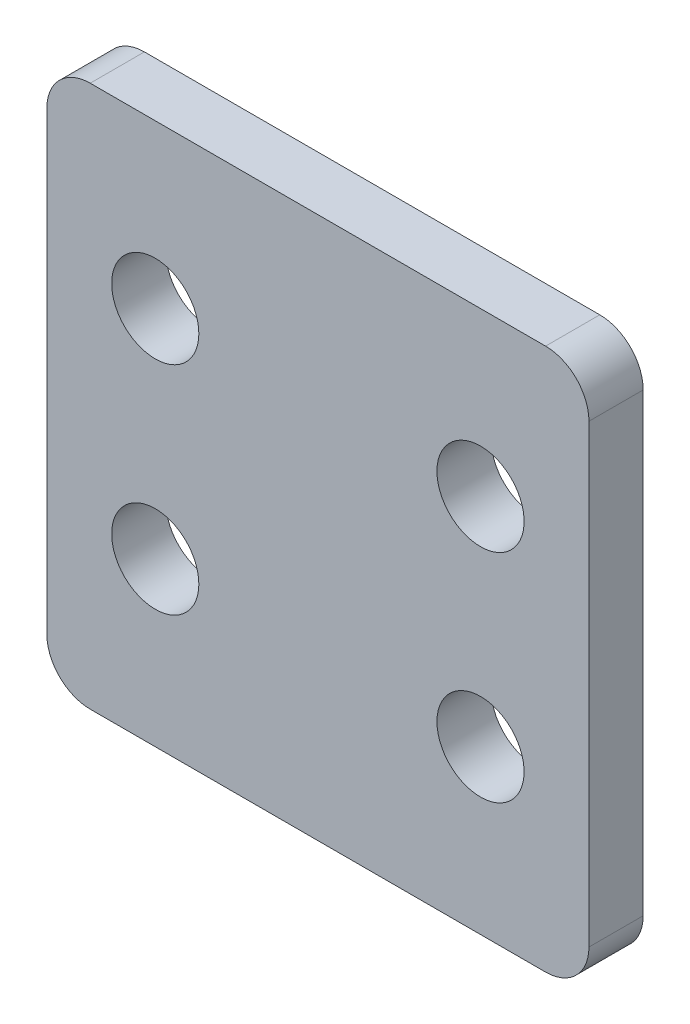
ISO-10303-21;
HEADER;
FILE_DESCRIPTION(('STEP AP214'),'2;1');
FILE_NAME('part.step','',(''),(''),'','','');
FILE_SCHEMA(('AUTOMOTIVE_DESIGN { 1 0 10303 214 1 1 1 1 }'));
ENDSEC;
DATA;
#1=APPLICATION_CONTEXT('core data for automotive mechanical design processes');
#2=APPLICATION_PROTOCOL_DEFINITION('international standard','automotive_design',2000,#1);
#3=PRODUCT_CONTEXT('',#1,'mechanical');
#4=PRODUCT('Part','Part','',(#3));
#5=PRODUCT_RELATED_PRODUCT_CATEGORY('part','',(#4));
#6=PRODUCT_DEFINITION_FORMATION('','',#4);
#7=PRODUCT_DEFINITION_CONTEXT('part definition',#1,'design');
#8=PRODUCT_DEFINITION('design','',#6,#7);
#9=PRODUCT_DEFINITION_SHAPE('','',#8);
#10=(LENGTH_UNIT() NAMED_UNIT(*) SI_UNIT(.MILLI.,.METRE.));
#11=(NAMED_UNIT(*) PLANE_ANGLE_UNIT() SI_UNIT($,.RADIAN.));
#12=(NAMED_UNIT(*) SI_UNIT($,.STERADIAN.) SOLID_ANGLE_UNIT());
#13=UNCERTAINTY_MEASURE_WITH_UNIT(LENGTH_MEASURE(1.E-05),#10,'distance_accuracy_value','');
#14=(GEOMETRIC_REPRESENTATION_CONTEXT(3) GLOBAL_UNCERTAINTY_ASSIGNED_CONTEXT((#13)) GLOBAL_UNIT_ASSIGNED_CONTEXT((#10,
#11,#12)) REPRESENTATION_CONTEXT('',''));
#15=CARTESIAN_POINT('',(0.,0.,0.));
#16=DIRECTION('',(0.,0.,1.));
#17=DIRECTION('',(1.,0.,0.));
#18=AXIS2_PLACEMENT_3D('',#15,#16,#17);
#19=CARTESIAN_POINT('',(0.,0.,3.175));
#20=DIRECTION('',(0.,0.,-1.));
#21=DIRECTION('',(-1.,0.,0.));
#22=AXIS2_PLACEMENT_3D('',#19,#20,#21);
#23=PLANE('',#22);
#24=DIRECTION('',(-1.,0.,0.));
#25=VECTOR('',#24,1.);
#26=CARTESIAN_POINT('',(-15.875,15.875,3.175));
#27=LINE('',#26,#25);
#28=CARTESIAN_POINT('',(13.335,15.875,3.175));
#29=VERTEX_POINT('',#28);
#30=CARTESIAN_POINT('',(-13.335,15.875,3.175));
#31=VERTEX_POINT('',#30);
#32=EDGE_CURVE('E170',#29,#31,#27,.T.);
#33=ORIENTED_EDGE('',*,*,#32,.T.);
#34=CARTESIAN_POINT('',(-13.335,13.335,3.175));
#35=DIRECTION('',(0.,0.,-1.));
#36=DIRECTION('',(-1.,0.,0.));
#37=AXIS2_PLACEMENT_3D('',#34,#35,#36);
#38=CIRCLE('',#37,2.54);
#39=CARTESIAN_POINT('',(-15.875,13.335,3.175));
#40=VERTEX_POINT('',#39);
#41=EDGE_CURVE('E151',#31,#40,#38,.F.);
#42=ORIENTED_EDGE('',*,*,#41,.T.);
#43=DIRECTION('',(0.,-1.,0.));
#44=VECTOR('',#43,1.);
#45=CARTESIAN_POINT('',(-15.875,-15.875,3.175));
#46=LINE('',#45,#44);
#47=CARTESIAN_POINT('',(-15.875,-13.335,3.175));
#48=VERTEX_POINT('',#47);
#49=EDGE_CURVE('E121',#40,#48,#46,.T.);
#50=ORIENTED_EDGE('',*,*,#49,.T.);
#51=CARTESIAN_POINT('',(-13.335,-13.335,3.175));
#52=DIRECTION('',(0.,0.,-1.));
#53=DIRECTION('',(-1.,0.,0.));
#54=AXIS2_PLACEMENT_3D('',#51,#52,#53);
#55=CIRCLE('',#54,2.54);
#56=CARTESIAN_POINT('',(-13.335,-15.875,3.175));
#57=VERTEX_POINT('',#56);
#58=EDGE_CURVE('E57',#48,#57,#55,.F.);
#59=ORIENTED_EDGE('',*,*,#58,.T.);
#60=DIRECTION('',(1.,0.,0.));
#61=VECTOR('',#60,1.);
#62=CARTESIAN_POINT('',(-15.875,-15.875,3.175));
#63=LINE('',#62,#61);
#64=CARTESIAN_POINT('',(13.335,-15.875,3.175));
#65=VERTEX_POINT('',#64);
#66=EDGE_CURVE('E137',#57,#65,#63,.T.);
#67=ORIENTED_EDGE('',*,*,#66,.T.);
#68=CARTESIAN_POINT('',(13.335,-13.335,3.175));
#69=DIRECTION('',(0.,0.,-1.));
#70=DIRECTION('',(-1.,0.,0.));
#71=AXIS2_PLACEMENT_3D('',#68,#69,#70);
#72=CIRCLE('',#71,2.54);
#73=CARTESIAN_POINT('',(15.875,-13.335,3.175));
#74=VERTEX_POINT('',#73);
#75=EDGE_CURVE('E148',#65,#74,#72,.F.);
#76=ORIENTED_EDGE('',*,*,#75,.T.);
#77=DIRECTION('',(0.,1.,0.));
#78=VECTOR('',#77,1.);
#79=CARTESIAN_POINT('',(15.875,-15.875,3.175));
#80=LINE('',#79,#78);
#81=CARTESIAN_POINT('',(15.875,13.335,3.175));
#82=VERTEX_POINT('',#81);
#83=EDGE_CURVE('E131',#74,#82,#80,.T.);
#84=ORIENTED_EDGE('',*,*,#83,.T.);
#85=CARTESIAN_POINT('',(13.335,13.335,3.175));
#86=DIRECTION('',(0.,0.,-1.));
#87=DIRECTION('',(-1.,0.,0.));
#88=AXIS2_PLACEMENT_3D('',#85,#86,#87);
#89=CIRCLE('',#88,2.54);
#90=EDGE_CURVE('E146',#82,#29,#89,.F.);
#91=ORIENTED_EDGE('',*,*,#90,.T.);
#92=EDGE_LOOP('',(#33,#42,#50,#59,#67,#76,#84,#91));
#93=FACE_BOUND('',#92,.T.);
#94=CARTESIAN_POINT('',(-9.52499999999991,-6.35,3.175));
#95=DIRECTION('',(0.,0.,1.));
#96=DIRECTION('',(1.,0.,0.));
#97=AXIS2_PLACEMENT_3D('',#94,#95,#96);
#98=CIRCLE('',#97,2.5527);
#99=CARTESIAN_POINT('',(-6.97229999999991,-6.35,3.175));
#100=VERTEX_POINT('',#99);
#101=EDGE_CURVE('E175',#100,#100,#98,.T.);
#102=ORIENTED_EDGE('',*,*,#101,.F.);
#103=EDGE_LOOP('',(#102));
#104=FACE_BOUND('',#103,.T.);
#105=CARTESIAN_POINT('',(9.52499999999991,-6.35,3.175));
#106=DIRECTION('',(0.,0.,1.));
#107=DIRECTION('',(-1.,0.,0.));
#108=AXIS2_PLACEMENT_3D('',#105,#106,#107);
#109=CIRCLE('',#108,2.5527);
#110=CARTESIAN_POINT('',(6.97229999999991,-6.35,3.175));
#111=VERTEX_POINT('',#110);
#112=EDGE_CURVE('E184',#111,#111,#109,.T.);
#113=ORIENTED_EDGE('',*,*,#112,.F.);
#114=EDGE_LOOP('',(#113));
#115=FACE_BOUND('',#114,.T.);
#116=CARTESIAN_POINT('',(-9.52499999999996,6.35,3.175));
#117=DIRECTION('',(0.,0.,1.));
#118=DIRECTION('',(1.,0.,0.));
#119=AXIS2_PLACEMENT_3D('',#116,#117,#118);
#120=CIRCLE('',#119,2.5527);
#121=CARTESIAN_POINT('',(-6.97229999999996,6.35,3.175));
#122=VERTEX_POINT('',#121);
#123=EDGE_CURVE('E189',#122,#122,#120,.T.);
#124=ORIENTED_EDGE('',*,*,#123,.F.);
#125=EDGE_LOOP('',(#124));
#126=FACE_BOUND('',#125,.T.);
#127=CARTESIAN_POINT('',(9.52499999999996,6.35,3.175));
#128=DIRECTION('',(0.,0.,1.));
#129=DIRECTION('',(-1.,0.,0.));
#130=AXIS2_PLACEMENT_3D('',#127,#128,#129);
#131=CIRCLE('',#130,2.5527);
#132=CARTESIAN_POINT('',(6.97229999999996,6.35,3.175));
#133=VERTEX_POINT('',#132);
#134=EDGE_CURVE('E195',#133,#133,#131,.T.);
#135=ORIENTED_EDGE('',*,*,#134,.F.);
#136=EDGE_LOOP('',(#135));
#137=FACE_BOUND('',#136,.T.);
#138=ADVANCED_FACE('F35',(#93,#104,#115,#126,#137),#23,.F.);
#139=CARTESIAN_POINT('',(0.,0.,0.));
#140=DIRECTION('',(0.,0.,-1.));
#141=DIRECTION('',(-1.,0.,0.));
#142=AXIS2_PLACEMENT_3D('',#139,#140,#141);
#143=PLANE('',#142);
#144=CARTESIAN_POINT('',(-9.52499999999996,6.35,0.));
#145=DIRECTION('',(0.,0.,1.));
#146=DIRECTION('',(1.,0.,0.));
#147=AXIS2_PLACEMENT_3D('',#144,#145,#146);
#148=CIRCLE('',#147,2.5527);
#149=CARTESIAN_POINT('',(-6.97229999999996,6.35,0.));
#150=VERTEX_POINT('',#149);
#151=EDGE_CURVE('E192',#150,#150,#148,.T.);
#152=ORIENTED_EDGE('',*,*,#151,.T.);
#153=EDGE_LOOP('',(#152));
#154=FACE_BOUND('',#153,.T.);
#155=CARTESIAN_POINT('',(-9.52499999999991,-6.35,0.));
#156=DIRECTION('',(0.,0.,1.));
#157=DIRECTION('',(1.,0.,0.));
#158=AXIS2_PLACEMENT_3D('',#155,#156,#157);
#159=CIRCLE('',#158,2.5527);
#160=CARTESIAN_POINT('',(-6.97229999999991,-6.35,0.));
#161=VERTEX_POINT('',#160);
#162=EDGE_CURVE('E177',#161,#161,#159,.T.);
#163=ORIENTED_EDGE('',*,*,#162,.T.);
#164=EDGE_LOOP('',(#163));
#165=FACE_BOUND('',#164,.T.);
#166=DIRECTION('',(0.,-1.,0.));
#167=VECTOR('',#166,1.);
#168=CARTESIAN_POINT('',(-15.875,-15.875,0.));
#169=LINE('',#168,#167);
#170=CARTESIAN_POINT('',(-15.875,13.335,0.));
#171=VERTEX_POINT('',#170);
#172=CARTESIAN_POINT('',(-15.875,-13.335,0.));
#173=VERTEX_POINT('',#172);
#174=EDGE_CURVE('E119',#171,#173,#169,.T.);
#175=ORIENTED_EDGE('',*,*,#174,.F.);
#176=CARTESIAN_POINT('',(-13.335,13.335,0.));
#177=DIRECTION('',(0.,0.,-1.));
#178=DIRECTION('',(-1.,0.,0.));
#179=AXIS2_PLACEMENT_3D('',#176,#177,#178);
#180=CIRCLE('',#179,2.54);
#181=CARTESIAN_POINT('',(-13.335,15.875,0.));
#182=VERTEX_POINT('',#181);
#183=EDGE_CURVE('E102',#171,#182,#180,.T.);
#184=ORIENTED_EDGE('',*,*,#183,.T.);
#185=DIRECTION('',(-1.,0.,0.));
#186=VECTOR('',#185,1.);
#187=CARTESIAN_POINT('',(-15.875,15.875,0.));
#188=LINE('',#187,#186);
#189=CARTESIAN_POINT('',(13.335,15.875,0.));
#190=VERTEX_POINT('',#189);
#191=EDGE_CURVE('E129',#190,#182,#188,.T.);
#192=ORIENTED_EDGE('',*,*,#191,.F.);
#193=CARTESIAN_POINT('',(13.335,13.335,0.));
#194=DIRECTION('',(0.,0.,-1.));
#195=DIRECTION('',(-1.,0.,0.));
#196=AXIS2_PLACEMENT_3D('',#193,#194,#195);
#197=CIRCLE('',#196,2.54);
#198=CARTESIAN_POINT('',(15.875,13.335,0.));
#199=VERTEX_POINT('',#198);
#200=EDGE_CURVE('E122',#190,#199,#197,.T.);
#201=ORIENTED_EDGE('',*,*,#200,.T.);
#202=DIRECTION('',(0.,1.,0.));
#203=VECTOR('',#202,1.);
#204=CARTESIAN_POINT('',(15.875,-15.875,0.));
#205=LINE('',#204,#203);
#206=CARTESIAN_POINT('',(15.875,-13.335,0.));
#207=VERTEX_POINT('',#206);
#208=EDGE_CURVE('E133',#207,#199,#205,.T.);
#209=ORIENTED_EDGE('',*,*,#208,.F.);
#210=CARTESIAN_POINT('',(13.335,-13.335,0.));
#211=DIRECTION('',(0.,0.,-1.));
#212=DIRECTION('',(-1.,0.,0.));
#213=AXIS2_PLACEMENT_3D('',#210,#211,#212);
#214=CIRCLE('',#213,2.54);
#215=CARTESIAN_POINT('',(13.335,-15.875,0.));
#216=VERTEX_POINT('',#215);
#217=EDGE_CURVE('E140',#207,#216,#214,.T.);
#218=ORIENTED_EDGE('',*,*,#217,.T.);
#219=DIRECTION('',(1.,0.,0.));
#220=VECTOR('',#219,1.);
#221=CARTESIAN_POINT('',(-15.875,-15.875,0.));
#222=LINE('',#221,#220);
#223=CARTESIAN_POINT('',(-13.335,-15.875,0.));
#224=VERTEX_POINT('',#223);
#225=EDGE_CURVE('E128',#224,#216,#222,.T.);
#226=ORIENTED_EDGE('',*,*,#225,.F.);
#227=CARTESIAN_POINT('',(-13.335,-13.335,0.));
#228=DIRECTION('',(0.,0.,-1.));
#229=DIRECTION('',(-1.,0.,0.));
#230=AXIS2_PLACEMENT_3D('',#227,#228,#229);
#231=CIRCLE('',#230,2.54);
#232=EDGE_CURVE('E113',#224,#173,#231,.T.);
#233=ORIENTED_EDGE('',*,*,#232,.T.);
#234=EDGE_LOOP('',(#175,#184,#192,#201,#209,#218,#226,#233));
#235=FACE_BOUND('',#234,.T.);
#236=CARTESIAN_POINT('',(9.52499999999991,-6.35,0.));
#237=DIRECTION('',(0.,0.,1.));
#238=DIRECTION('',(-1.,0.,0.));
#239=AXIS2_PLACEMENT_3D('',#236,#237,#238);
#240=CIRCLE('',#239,2.5527);
#241=CARTESIAN_POINT('',(6.97229999999991,-6.35,0.));
#242=VERTEX_POINT('',#241);
#243=EDGE_CURVE('E186',#242,#242,#240,.T.);
#244=ORIENTED_EDGE('',*,*,#243,.T.);
#245=EDGE_LOOP('',(#244));
#246=FACE_BOUND('',#245,.T.);
#247=CARTESIAN_POINT('',(9.52499999999996,6.35,0.));
#248=DIRECTION('',(0.,0.,1.));
#249=DIRECTION('',(-1.,0.,0.));
#250=AXIS2_PLACEMENT_3D('',#247,#248,#249);
#251=CIRCLE('',#250,2.5527);
#252=CARTESIAN_POINT('',(6.97229999999996,6.35,0.));
#253=VERTEX_POINT('',#252);
#254=EDGE_CURVE('E198',#253,#253,#251,.T.);
#255=ORIENTED_EDGE('',*,*,#254,.T.);
#256=EDGE_LOOP('',(#255));
#257=FACE_BOUND('',#256,.T.);
#258=ADVANCED_FACE('F125',(#154,#165,#235,#246,#257),#143,.T.);
#259=CARTESIAN_POINT('',(15.875,-15.875,3.175));
#260=DIRECTION('',(-1.,0.,0.));
#261=DIRECTION('',(0.,0.,1.));
#262=AXIS2_PLACEMENT_3D('',#259,#260,#261);
#263=PLANE('',#262);
#264=ORIENTED_EDGE('',*,*,#83,.F.);
#265=DIRECTION('',(0.,0.,-1.));
#266=VECTOR('',#265,1.);
#267=CARTESIAN_POINT('',(15.875,-13.335,3.175));
#268=LINE('',#267,#266);
#269=EDGE_CURVE('E11',#74,#207,#268,.T.);
#270=ORIENTED_EDGE('',*,*,#269,.T.);
#271=ORIENTED_EDGE('',*,*,#208,.T.);
#272=DIRECTION('',(0.,0.,-1.));
#273=VECTOR('',#272,1.);
#274=CARTESIAN_POINT('',(15.875,13.335,3.175));
#275=LINE('',#274,#273);
#276=EDGE_CURVE('E43',#199,#82,#275,.F.);
#277=ORIENTED_EDGE('',*,*,#276,.T.);
#278=EDGE_LOOP('',(#264,#270,#271,#277));
#279=FACE_BOUND('',#278,.T.);
#280=ADVANCED_FACE('F161',(#279),#263,.F.);
#281=CARTESIAN_POINT('',(-15.875,15.875,3.175));
#282=DIRECTION('',(0.,-1.,0.));
#283=DIRECTION('',(0.,0.,-1.));
#284=AXIS2_PLACEMENT_3D('',#281,#282,#283);
#285=PLANE('',#284);
#286=ORIENTED_EDGE('',*,*,#191,.T.);
#287=DIRECTION('',(0.,0.,-1.));
#288=VECTOR('',#287,1.);
#289=CARTESIAN_POINT('',(-13.335,15.875,3.175));
#290=LINE('',#289,#288);
#291=EDGE_CURVE('E107',#182,#31,#290,.F.);
#292=ORIENTED_EDGE('',*,*,#291,.T.);
#293=ORIENTED_EDGE('',*,*,#32,.F.);
#294=DIRECTION('',(0.,0.,-1.));
#295=VECTOR('',#294,1.);
#296=CARTESIAN_POINT('',(13.335,15.875,3.175));
#297=LINE('',#296,#295);
#298=EDGE_CURVE('E112',#29,#190,#297,.T.);
#299=ORIENTED_EDGE('',*,*,#298,.T.);
#300=EDGE_LOOP('',(#286,#292,#293,#299));
#301=FACE_BOUND('',#300,.T.);
#302=ADVANCED_FACE('F174',(#301),#285,.F.);
#303=CARTESIAN_POINT('',(-15.875,-15.875,3.175));
#304=DIRECTION('',(1.,0.,0.));
#305=DIRECTION('',(0.,0.,-1.));
#306=AXIS2_PLACEMENT_3D('',#303,#304,#305);
#307=PLANE('',#306);
#308=ORIENTED_EDGE('',*,*,#49,.F.);
#309=DIRECTION('',(0.,0.,-1.));
#310=VECTOR('',#309,1.);
#311=CARTESIAN_POINT('',(-15.875,13.335,3.175));
#312=LINE('',#311,#310);
#313=EDGE_CURVE('E106',#40,#171,#312,.T.);
#314=ORIENTED_EDGE('',*,*,#313,.T.);
#315=ORIENTED_EDGE('',*,*,#174,.T.);
#316=DIRECTION('',(0.,0.,-1.));
#317=VECTOR('',#316,1.);
#318=CARTESIAN_POINT('',(-15.875,-13.335,3.175));
#319=LINE('',#318,#317);
#320=EDGE_CURVE('E123',#173,#48,#319,.F.);
#321=ORIENTED_EDGE('',*,*,#320,.T.);
#322=EDGE_LOOP('',(#308,#314,#315,#321));
#323=FACE_BOUND('',#322,.T.);
#324=ADVANCED_FACE('F118',(#323),#307,.F.);
#325=CARTESIAN_POINT('',(-15.875,-15.875,3.175));
#326=DIRECTION('',(0.,1.,0.));
#327=DIRECTION('',(0.,0.,1.));
#328=AXIS2_PLACEMENT_3D('',#325,#326,#327);
#329=PLANE('',#328);
#330=ORIENTED_EDGE('',*,*,#66,.F.);
#331=DIRECTION('',(0.,0.,-1.));
#332=VECTOR('',#331,1.);
#333=CARTESIAN_POINT('',(-13.335,-15.875,3.175));
#334=LINE('',#333,#332);
#335=EDGE_CURVE('E154',#57,#224,#334,.T.);
#336=ORIENTED_EDGE('',*,*,#335,.T.);
#337=ORIENTED_EDGE('',*,*,#225,.T.);
#338=DIRECTION('',(0.,0.,-1.));
#339=VECTOR('',#338,1.);
#340=CARTESIAN_POINT('',(13.335,-15.875,3.175));
#341=LINE('',#340,#339);
#342=EDGE_CURVE('E50',#216,#65,#341,.F.);
#343=ORIENTED_EDGE('',*,*,#342,.T.);
#344=EDGE_LOOP('',(#330,#336,#337,#343));
#345=FACE_BOUND('',#344,.T.);
#346=ADVANCED_FACE('F218',(#345),#329,.F.);
#347=CARTESIAN_POINT('',(-9.52499999999991,-6.35,3.175));
#348=DIRECTION('',(0.,0.,-1.));
#349=DIRECTION('',(-1.,0.,0.));
#350=AXIS2_PLACEMENT_3D('',#347,#348,#349);
#351=CYLINDRICAL_SURFACE('',#350,2.5527);
#352=ORIENTED_EDGE('',*,*,#101,.T.);
#353=EDGE_LOOP('',(#352));
#354=FACE_BOUND('',#353,.T.);
#355=ORIENTED_EDGE('',*,*,#162,.F.);
#356=EDGE_LOOP('',(#355));
#357=FACE_BOUND('',#356,.T.);
#358=ADVANCED_FACE('F215',(#354,#357),#351,.F.);
#359=CARTESIAN_POINT('',(9.52499999999991,-6.35,3.175));
#360=DIRECTION('',(0.,0.,-1.));
#361=DIRECTION('',(-1.,0.,0.));
#362=AXIS2_PLACEMENT_3D('',#359,#360,#361);
#363=CYLINDRICAL_SURFACE('',#362,2.5527);
#364=ORIENTED_EDGE('',*,*,#112,.T.);
#365=EDGE_LOOP('',(#364));
#366=FACE_BOUND('',#365,.T.);
#367=ORIENTED_EDGE('',*,*,#243,.F.);
#368=EDGE_LOOP('',(#367));
#369=FACE_BOUND('',#368,.T.);
#370=ADVANCED_FACE('F310',(#366,#369),#363,.F.);
#371=CARTESIAN_POINT('',(-9.52499999999996,6.35,3.175));
#372=DIRECTION('',(0.,0.,-1.));
#373=DIRECTION('',(-1.,0.,0.));
#374=AXIS2_PLACEMENT_3D('',#371,#372,#373);
#375=CYLINDRICAL_SURFACE('',#374,2.5527);
#376=ORIENTED_EDGE('',*,*,#123,.T.);
#377=EDGE_LOOP('',(#376));
#378=FACE_BOUND('',#377,.T.);
#379=ORIENTED_EDGE('',*,*,#151,.F.);
#380=EDGE_LOOP('',(#379));
#381=FACE_BOUND('',#380,.T.);
#382=ADVANCED_FACE('F301',(#378,#381),#375,.F.);
#383=CARTESIAN_POINT('',(9.52499999999996,6.35,3.175));
#384=DIRECTION('',(0.,0.,-1.));
#385=DIRECTION('',(-1.,0.,0.));
#386=AXIS2_PLACEMENT_3D('',#383,#384,#385);
#387=CYLINDRICAL_SURFACE('',#386,2.5527);
#388=ORIENTED_EDGE('',*,*,#134,.T.);
#389=EDGE_LOOP('',(#388));
#390=FACE_BOUND('',#389,.T.);
#391=ORIENTED_EDGE('',*,*,#254,.F.);
#392=EDGE_LOOP('',(#391));
#393=FACE_BOUND('',#392,.T.);
#394=ADVANCED_FACE('F204',(#390,#393),#387,.F.);
#395=CARTESIAN_POINT('',(-13.335,13.335,3.175));
#396=DIRECTION('',(0.,0.,-1.));
#397=DIRECTION('',(-1.,0.,0.));
#398=AXIS2_PLACEMENT_3D('',#395,#396,#397);
#399=CYLINDRICAL_SURFACE('',#398,2.54);
#400=ORIENTED_EDGE('',*,*,#41,.F.);
#401=ORIENTED_EDGE('',*,*,#291,.F.);
#402=ORIENTED_EDGE('',*,*,#183,.F.);
#403=ORIENTED_EDGE('',*,*,#313,.F.);
#404=EDGE_LOOP('',(#400,#401,#402,#403));
#405=FACE_BOUND('',#404,.T.);
#406=ADVANCED_FACE('F105',(#405),#399,.T.);
#407=CARTESIAN_POINT('',(-13.335,-13.335,3.175));
#408=DIRECTION('',(0.,0.,-1.));
#409=DIRECTION('',(-1.,0.,0.));
#410=AXIS2_PLACEMENT_3D('',#407,#408,#409);
#411=CYLINDRICAL_SURFACE('',#410,2.54);
#412=ORIENTED_EDGE('',*,*,#58,.F.);
#413=ORIENTED_EDGE('',*,*,#320,.F.);
#414=ORIENTED_EDGE('',*,*,#232,.F.);
#415=ORIENTED_EDGE('',*,*,#335,.F.);
#416=EDGE_LOOP('',(#412,#413,#414,#415));
#417=FACE_BOUND('',#416,.T.);
#418=ADVANCED_FACE('F229',(#417),#411,.T.);
#419=CARTESIAN_POINT('',(13.335,-13.335,3.175));
#420=DIRECTION('',(0.,0.,-1.));
#421=DIRECTION('',(-1.,0.,0.));
#422=AXIS2_PLACEMENT_3D('',#419,#420,#421);
#423=CYLINDRICAL_SURFACE('',#422,2.54);
#424=ORIENTED_EDGE('',*,*,#75,.F.);
#425=ORIENTED_EDGE('',*,*,#342,.F.);
#426=ORIENTED_EDGE('',*,*,#217,.F.);
#427=ORIENTED_EDGE('',*,*,#269,.F.);
#428=EDGE_LOOP('',(#424,#425,#426,#427));
#429=FACE_BOUND('',#428,.T.);
#430=ADVANCED_FACE('F231',(#429),#423,.T.);
#431=CARTESIAN_POINT('',(13.335,13.335,3.175));
#432=DIRECTION('',(0.,0.,-1.));
#433=DIRECTION('',(-1.,0.,0.));
#434=AXIS2_PLACEMENT_3D('',#431,#432,#433);
#435=CYLINDRICAL_SURFACE('',#434,2.54);
#436=ORIENTED_EDGE('',*,*,#90,.F.);
#437=ORIENTED_EDGE('',*,*,#276,.F.);
#438=ORIENTED_EDGE('',*,*,#200,.F.);
#439=ORIENTED_EDGE('',*,*,#298,.F.);
#440=EDGE_LOOP('',(#436,#437,#438,#439));
#441=FACE_BOUND('',#440,.T.);
#442=ADVANCED_FACE('F37',(#441),#435,.T.);
#443=CLOSED_SHELL('',(#138,#258,#280,#302,#324,#346,#358,#370,#382,#394,#406,#418,#430,#442));
#444=MANIFOLD_SOLID_BREP('B2',#443);
#445=ADVANCED_BREP_SHAPE_REPRESENTATION('',(#18,#444),#14);
#446=SHAPE_DEFINITION_REPRESENTATION(#9,#445);
ENDSEC;
END-ISO-10303-21;
